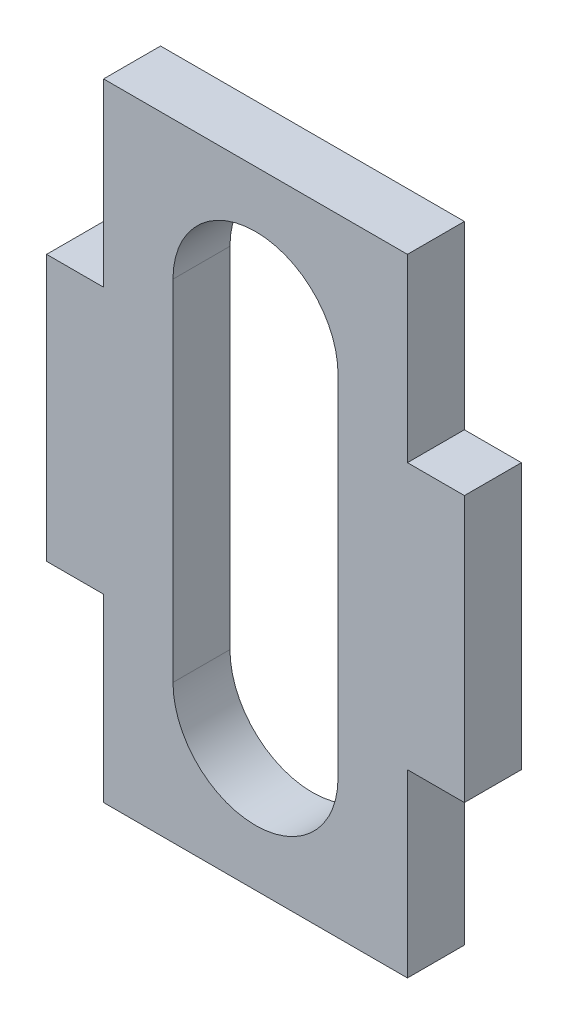
ISO-10303-21;
HEADER;
FILE_DESCRIPTION(('STEP AP214'),'2;1');
FILE_NAME('part.step','',(''),(''),'','','');
FILE_SCHEMA(('AUTOMOTIVE_DESIGN { 1 0 10303 214 1 1 1 1 }'));
ENDSEC;
DATA;
#1=APPLICATION_CONTEXT('core data for automotive mechanical design processes');
#2=APPLICATION_PROTOCOL_DEFINITION('international standard','automotive_design',2000,#1);
#3=PRODUCT_CONTEXT('',#1,'mechanical');
#4=PRODUCT('Part','Part','',(#3));
#5=PRODUCT_RELATED_PRODUCT_CATEGORY('part','',(#4));
#6=PRODUCT_DEFINITION_FORMATION('','',#4);
#7=PRODUCT_DEFINITION_CONTEXT('part definition',#1,'design');
#8=PRODUCT_DEFINITION('design','',#6,#7);
#9=PRODUCT_DEFINITION_SHAPE('','',#8);
#10=(LENGTH_UNIT() NAMED_UNIT(*) SI_UNIT(.MILLI.,.METRE.));
#11=(NAMED_UNIT(*) PLANE_ANGLE_UNIT() SI_UNIT($,.RADIAN.));
#12=(NAMED_UNIT(*) SI_UNIT($,.STERADIAN.) SOLID_ANGLE_UNIT());
#13=UNCERTAINTY_MEASURE_WITH_UNIT(LENGTH_MEASURE(1.E-05),#10,'distance_accuracy_value','');
#14=(GEOMETRIC_REPRESENTATION_CONTEXT(3) GLOBAL_UNCERTAINTY_ASSIGNED_CONTEXT((#13)) GLOBAL_UNIT_ASSIGNED_CONTEXT((#10,
#11,#12)) REPRESENTATION_CONTEXT('',''));
#15=CARTESIAN_POINT('',(0.,0.,0.));
#16=DIRECTION('',(0.,0.,1.));
#17=DIRECTION('',(1.,0.,0.));
#18=AXIS2_PLACEMENT_3D('',#15,#16,#17);
#19=CARTESIAN_POINT('',(7.99999999999999,-16.5,3.));
#20=DIRECTION('',(-1.,0.,0.));
#21=DIRECTION('',(0.,0.,1.));
#22=AXIS2_PLACEMENT_3D('',#19,#20,#21);
#23=PLANE('',#22);
#24=DIRECTION('',(0.,1.,0.));
#25=VECTOR('',#24,1.);
#26=CARTESIAN_POINT('',(7.99999999999999,-16.5,0.));
#27=LINE('',#26,#25);
#28=CARTESIAN_POINT('',(7.99999999999999,-16.5,0.));
#29=VERTEX_POINT('',#28);
#30=CARTESIAN_POINT('',(8.,-7.,0.));
#31=VERTEX_POINT('',#30);
#32=EDGE_CURVE('E237',#29,#31,#27,.T.);
#33=ORIENTED_EDGE('',*,*,#32,.T.);
#34=DIRECTION('',(0.,0.,1.));
#35=VECTOR('',#34,1.);
#36=CARTESIAN_POINT('',(7.99999999999999,-7.,3.));
#37=LINE('',#36,#35);
#38=CARTESIAN_POINT('',(8.,-7.,3.));
#39=VERTEX_POINT('',#38);
#40=EDGE_CURVE('E220',#31,#39,#37,.T.);
#41=ORIENTED_EDGE('',*,*,#40,.T.);
#42=DIRECTION('',(0.,1.,0.));
#43=VECTOR('',#42,1.);
#44=CARTESIAN_POINT('',(7.99999999999999,-16.5,3.));
#45=LINE('',#44,#43);
#46=CARTESIAN_POINT('',(7.99999999999999,-16.5,3.));
#47=VERTEX_POINT('',#46);
#48=EDGE_CURVE('E224',#47,#39,#45,.T.);
#49=ORIENTED_EDGE('',*,*,#48,.F.);
#50=DIRECTION('',(0.,0.,-1.));
#51=VECTOR('',#50,1.);
#52=CARTESIAN_POINT('',(7.99999999999999,-16.5,3.));
#53=LINE('',#52,#51);
#54=EDGE_CURVE('E236',#47,#29,#53,.T.);
#55=ORIENTED_EDGE('',*,*,#54,.T.);
#56=EDGE_LOOP('',(#33,#41,#49,#55));
#57=FACE_BOUND('',#56,.T.);
#58=ADVANCED_FACE('F37',(#57),#23,.F.);
#59=CARTESIAN_POINT('',(-8.00000000000001,-16.5,3.));
#60=DIRECTION('',(1.,0.,0.));
#61=DIRECTION('',(0.,0.,-1.));
#62=AXIS2_PLACEMENT_3D('',#59,#60,#61);
#63=PLANE('',#62);
#64=DIRECTION('',(0.,-1.,0.));
#65=VECTOR('',#64,1.);
#66=CARTESIAN_POINT('',(-8.00000000000001,-16.5,3.));
#67=LINE('',#66,#65);
#68=CARTESIAN_POINT('',(-8.00000000000001,-7.,3.));
#69=VERTEX_POINT('',#68);
#70=CARTESIAN_POINT('',(-8.00000000000001,-16.5,3.));
#71=VERTEX_POINT('',#70);
#72=EDGE_CURVE('E230',#69,#71,#67,.T.);
#73=ORIENTED_EDGE('',*,*,#72,.F.);
#74=DIRECTION('',(0.,0.,-1.));
#75=VECTOR('',#74,1.);
#76=CARTESIAN_POINT('',(-8.00000000000001,-7.,3.));
#77=LINE('',#76,#75);
#78=CARTESIAN_POINT('',(-8.00000000000001,-7.,0.));
#79=VERTEX_POINT('',#78);
#80=EDGE_CURVE('E217',#69,#79,#77,.T.);
#81=ORIENTED_EDGE('',*,*,#80,.T.);
#82=DIRECTION('',(0.,-1.,0.));
#83=VECTOR('',#82,1.);
#84=CARTESIAN_POINT('',(-8.00000000000001,-16.5,0.));
#85=LINE('',#84,#83);
#86=CARTESIAN_POINT('',(-8.00000000000001,-16.5,0.));
#87=VERTEX_POINT('',#86);
#88=EDGE_CURVE('E242',#79,#87,#85,.T.);
#89=ORIENTED_EDGE('',*,*,#88,.T.);
#90=DIRECTION('',(0.,0.,-1.));
#91=VECTOR('',#90,1.);
#92=CARTESIAN_POINT('',(-8.00000000000001,-16.5,3.));
#93=LINE('',#92,#91);
#94=EDGE_CURVE('E250',#71,#87,#93,.T.);
#95=ORIENTED_EDGE('',*,*,#94,.F.);
#96=EDGE_LOOP('',(#73,#81,#89,#95));
#97=FACE_BOUND('',#96,.T.);
#98=ADVANCED_FACE('F284',(#97),#63,.F.);
#99=CARTESIAN_POINT('',(7.99999999999999,7.,3.));
#100=VERTEX_POINT('',#99);
#101=CARTESIAN_POINT('',(7.99999999999999,16.5,3.));
#102=VERTEX_POINT('',#101);
#103=EDGE_CURVE('E228',#100,#102,#45,.T.);
#104=ORIENTED_EDGE('',*,*,#103,.F.);
#105=DIRECTION('',(0.,0.,-1.));
#106=VECTOR('',#105,1.);
#107=CARTESIAN_POINT('',(7.99999999999999,7.,3.));
#108=LINE('',#107,#106);
#109=CARTESIAN_POINT('',(8.,7.,0.));
#110=VERTEX_POINT('',#109);
#111=EDGE_CURVE('E214',#100,#110,#108,.T.);
#112=ORIENTED_EDGE('',*,*,#111,.T.);
#113=CARTESIAN_POINT('',(7.99999999999999,16.5,0.));
#114=VERTEX_POINT('',#113);
#115=EDGE_CURVE('E223',#110,#114,#27,.T.);
#116=ORIENTED_EDGE('',*,*,#115,.T.);
#117=DIRECTION('',(0.,0.,-1.));
#118=VECTOR('',#117,1.);
#119=CARTESIAN_POINT('',(7.99999999999999,16.5,3.));
#120=LINE('',#119,#118);
#121=EDGE_CURVE('E256',#102,#114,#120,.T.);
#122=ORIENTED_EDGE('',*,*,#121,.F.);
#123=EDGE_LOOP('',(#104,#112,#116,#122));
#124=FACE_BOUND('',#123,.T.);
#125=ADVANCED_FACE('F39',(#124),#23,.F.);
#126=CARTESIAN_POINT('',(-8.00000000000001,16.5,3.));
#127=DIRECTION('',(0.,-1.,0.));
#128=DIRECTION('',(0.,0.,-1.));
#129=AXIS2_PLACEMENT_3D('',#126,#127,#128);
#130=PLANE('',#129);
#131=DIRECTION('',(-1.,0.,0.));
#132=VECTOR('',#131,1.);
#133=CARTESIAN_POINT('',(-8.00000000000001,16.5,0.));
#134=LINE('',#133,#132);
#135=CARTESIAN_POINT('',(-8.00000000000001,16.5,0.));
#136=VERTEX_POINT('',#135);
#137=EDGE_CURVE('E240',#114,#136,#134,.T.);
#138=ORIENTED_EDGE('',*,*,#137,.T.);
#139=DIRECTION('',(0.,0.,-1.));
#140=VECTOR('',#139,1.);
#141=CARTESIAN_POINT('',(-8.00000000000001,16.5,3.));
#142=LINE('',#141,#140);
#143=CARTESIAN_POINT('',(-8.00000000000001,16.5,3.));
#144=VERTEX_POINT('',#143);
#145=EDGE_CURVE('E253',#144,#136,#142,.T.);
#146=ORIENTED_EDGE('',*,*,#145,.F.);
#147=DIRECTION('',(-1.,0.,0.));
#148=VECTOR('',#147,1.);
#149=CARTESIAN_POINT('',(-8.00000000000001,16.5,3.));
#150=LINE('',#149,#148);
#151=EDGE_CURVE('E227',#102,#144,#150,.T.);
#152=ORIENTED_EDGE('',*,*,#151,.F.);
#153=ORIENTED_EDGE('',*,*,#121,.T.);
#154=EDGE_LOOP('',(#138,#146,#152,#153));
#155=FACE_BOUND('',#154,.T.);
#156=ADVANCED_FACE('F293',(#155),#130,.F.);
#157=CARTESIAN_POINT('',(-8.00000000000001,7.,0.));
#158=VERTEX_POINT('',#157);
#159=EDGE_CURVE('E243',#136,#158,#85,.T.);
#160=ORIENTED_EDGE('',*,*,#159,.T.);
#161=DIRECTION('',(0.,0.,1.));
#162=VECTOR('',#161,1.);
#163=CARTESIAN_POINT('',(-8.00000000000001,7.,3.));
#164=LINE('',#163,#162);
#165=CARTESIAN_POINT('',(-8.00000000000001,7.,3.));
#166=VERTEX_POINT('',#165);
#167=EDGE_CURVE('E205',#158,#166,#164,.T.);
#168=ORIENTED_EDGE('',*,*,#167,.T.);
#169=EDGE_CURVE('E231',#144,#166,#67,.T.);
#170=ORIENTED_EDGE('',*,*,#169,.F.);
#171=ORIENTED_EDGE('',*,*,#145,.T.);
#172=EDGE_LOOP('',(#160,#168,#170,#171));
#173=FACE_BOUND('',#172,.T.);
#174=ADVANCED_FACE('F291',(#173),#63,.F.);
#175=CARTESIAN_POINT('',(-8.00000000000001,-16.5,3.));
#176=DIRECTION('',(0.,1.,0.));
#177=DIRECTION('',(0.,0.,1.));
#178=AXIS2_PLACEMENT_3D('',#175,#176,#177);
#179=PLANE('',#178);
#180=DIRECTION('',(1.,0.,0.));
#181=VECTOR('',#180,1.);
#182=CARTESIAN_POINT('',(-8.00000000000001,-16.5,0.));
#183=LINE('',#182,#181);
#184=EDGE_CURVE('E246',#87,#29,#183,.T.);
#185=ORIENTED_EDGE('',*,*,#184,.T.);
#186=ORIENTED_EDGE('',*,*,#54,.F.);
#187=DIRECTION('',(1.,0.,0.));
#188=VECTOR('',#187,1.);
#189=CARTESIAN_POINT('',(-8.00000000000001,-16.5,3.));
#190=LINE('',#189,#188);
#191=EDGE_CURVE('E234',#71,#47,#190,.T.);
#192=ORIENTED_EDGE('',*,*,#191,.F.);
#193=ORIENTED_EDGE('',*,*,#94,.T.);
#194=EDGE_LOOP('',(#185,#186,#192,#193));
#195=FACE_BOUND('',#194,.T.);
#196=ADVANCED_FACE('F330',(#195),#179,.F.);
#197=CARTESIAN_POINT('',(0.,0.,3.));
#198=DIRECTION('',(0.,0.,-1.));
#199=DIRECTION('',(-1.,0.,0.));
#200=AXIS2_PLACEMENT_3D('',#197,#198,#199);
#201=PLANE('',#200);
#202=DIRECTION('',(0.,-1.,0.));
#203=VECTOR('',#202,1.);
#204=CARTESIAN_POINT('',(-4.34549492077303,9.19606588526633,3.));
#205=LINE('',#204,#203);
#206=CARTESIAN_POINT('',(-4.34549492077303,9.19606588526633,3.));
#207=VERTEX_POINT('',#206);
#208=CARTESIAN_POINT('',(-4.34549492077302,-9.19606588526633,3.));
#209=VERTEX_POINT('',#208);
#210=EDGE_CURVE('E161',#207,#209,#205,.T.);
#211=ORIENTED_EDGE('',*,*,#210,.F.);
#212=CARTESIAN_POINT('',(0.,9.19606588526633,3.));
#213=DIRECTION('',(0.,0.,1.));
#214=DIRECTION('',(1.,0.,0.));
#215=AXIS2_PLACEMENT_3D('',#212,#213,#214);
#216=CIRCLE('',#215,4.34549492077301);
#217=CARTESIAN_POINT('',(4.345494920773,9.19606588526633,3.));
#218=VERTEX_POINT('',#217);
#219=EDGE_CURVE('E52',#218,#207,#216,.T.);
#220=ORIENTED_EDGE('',*,*,#219,.F.);
#221=DIRECTION('',(0.,1.,0.));
#222=VECTOR('',#221,1.);
#223=CARTESIAN_POINT('',(4.345494920773,9.19606588526633,3.));
#224=LINE('',#223,#222);
#225=CARTESIAN_POINT('',(4.345494920773,-9.19606588526633,3.));
#226=VERTEX_POINT('',#225);
#227=EDGE_CURVE('E168',#226,#218,#224,.T.);
#228=ORIENTED_EDGE('',*,*,#227,.F.);
#229=CARTESIAN_POINT('',(0.,-9.19606588526633,3.));
#230=DIRECTION('',(0.,0.,1.));
#231=DIRECTION('',(1.,0.,0.));
#232=AXIS2_PLACEMENT_3D('',#229,#230,#231);
#233=CIRCLE('',#232,4.34549492077301);
#234=EDGE_CURVE('E152',#209,#226,#233,.T.);
#235=ORIENTED_EDGE('',*,*,#234,.F.);
#236=EDGE_LOOP('',(#211,#220,#228,#235));
#237=FACE_BOUND('',#236,.T.);
#238=ORIENTED_EDGE('',*,*,#169,.T.);
#239=DIRECTION('',(-1.,0.,0.));
#240=VECTOR('',#239,1.);
#241=CARTESIAN_POINT('',(-11.,7.,3.));
#242=LINE('',#241,#240);
#243=CARTESIAN_POINT('',(-11.,7.,3.));
#244=VERTEX_POINT('',#243);
#245=EDGE_CURVE('E194',#166,#244,#242,.T.);
#246=ORIENTED_EDGE('',*,*,#245,.T.);
#247=DIRECTION('',(0.,-1.,0.));
#248=VECTOR('',#247,1.);
#249=CARTESIAN_POINT('',(-11.,-7.,3.));
#250=LINE('',#249,#248);
#251=CARTESIAN_POINT('',(-11.,-7.,3.));
#252=VERTEX_POINT('',#251);
#253=EDGE_CURVE('E197',#244,#252,#250,.T.);
#254=ORIENTED_EDGE('',*,*,#253,.T.);
#255=DIRECTION('',(1.,0.,0.));
#256=VECTOR('',#255,1.);
#257=CARTESIAN_POINT('',(-11.,-7.,3.));
#258=LINE('',#257,#256);
#259=EDGE_CURVE('E182',#252,#69,#258,.T.);
#260=ORIENTED_EDGE('',*,*,#259,.T.);
#261=ORIENTED_EDGE('',*,*,#72,.T.);
#262=ORIENTED_EDGE('',*,*,#191,.T.);
#263=ORIENTED_EDGE('',*,*,#48,.T.);
#264=CARTESIAN_POINT('',(11.,-7.,3.));
#265=VERTEX_POINT('',#264);
#266=EDGE_CURVE('E200',#39,#265,#258,.T.);
#267=ORIENTED_EDGE('',*,*,#266,.T.);
#268=DIRECTION('',(0.,1.,0.));
#269=VECTOR('',#268,1.);
#270=CARTESIAN_POINT('',(11.,-7.,3.));
#271=LINE('',#270,#269);
#272=CARTESIAN_POINT('',(11.,7.,3.));
#273=VERTEX_POINT('',#272);
#274=EDGE_CURVE('E175',#265,#273,#271,.T.);
#275=ORIENTED_EDGE('',*,*,#274,.T.);
#276=EDGE_CURVE('E195',#273,#100,#242,.T.);
#277=ORIENTED_EDGE('',*,*,#276,.T.);
#278=ORIENTED_EDGE('',*,*,#103,.T.);
#279=ORIENTED_EDGE('',*,*,#151,.T.);
#280=EDGE_LOOP('',(#238,#246,#254,#260,#261,#262,#263,#267,#275,#277,#278,#279));
#281=FACE_BOUND('',#280,.T.);
#282=ADVANCED_FACE('F165',(#237,#281),#201,.F.);
#283=CARTESIAN_POINT('',(0.,0.,0.));
#284=DIRECTION('',(0.,0.,-1.));
#285=DIRECTION('',(-1.,0.,0.));
#286=AXIS2_PLACEMENT_3D('',#283,#284,#285);
#287=PLANE('',#286);
#288=CARTESIAN_POINT('',(0.,9.19606588526633,0.));
#289=DIRECTION('',(0.,0.,-1.));
#290=DIRECTION('',(-1.,0.,0.));
#291=AXIS2_PLACEMENT_3D('',#288,#289,#290);
#292=CIRCLE('',#291,4.34549492077301);
#293=CARTESIAN_POINT('',(-4.34549492077303,9.19606588526633,0.));
#294=VERTEX_POINT('',#293);
#295=CARTESIAN_POINT('',(4.345494920773,9.19606588526633,0.));
#296=VERTEX_POINT('',#295);
#297=EDGE_CURVE('E11',#294,#296,#292,.T.);
#298=ORIENTED_EDGE('',*,*,#297,.F.);
#299=DIRECTION('',(0.,1.,0.));
#300=VECTOR('',#299,1.);
#301=CARTESIAN_POINT('',(-4.34549492077303,0.,0.));
#302=LINE('',#301,#300);
#303=CARTESIAN_POINT('',(-4.34549492077302,-9.19606588526633,0.));
#304=VERTEX_POINT('',#303);
#305=EDGE_CURVE('E259',#304,#294,#302,.T.);
#306=ORIENTED_EDGE('',*,*,#305,.F.);
#307=CARTESIAN_POINT('',(0.,-9.19606588526633,0.));
#308=DIRECTION('',(0.,0.,-1.));
#309=DIRECTION('',(-1.,0.,0.));
#310=AXIS2_PLACEMENT_3D('',#307,#308,#309);
#311=CIRCLE('',#310,4.34549492077301);
#312=CARTESIAN_POINT('',(4.345494920773,-9.19606588526633,0.));
#313=VERTEX_POINT('',#312);
#314=EDGE_CURVE('E155',#313,#304,#311,.T.);
#315=ORIENTED_EDGE('',*,*,#314,.F.);
#316=DIRECTION('',(0.,-1.,0.));
#317=VECTOR('',#316,1.);
#318=CARTESIAN_POINT('',(4.345494920773,0.,0.));
#319=LINE('',#318,#317);
#320=EDGE_CURVE('E45',#296,#313,#319,.T.);
#321=ORIENTED_EDGE('',*,*,#320,.F.);
#322=EDGE_LOOP('',(#298,#306,#315,#321));
#323=FACE_BOUND('',#322,.T.);
#324=ORIENTED_EDGE('',*,*,#115,.F.);
#325=DIRECTION('',(-1.,0.,0.));
#326=VECTOR('',#325,1.);
#327=CARTESIAN_POINT('',(-11.,7.,0.));
#328=LINE('',#327,#326);
#329=CARTESIAN_POINT('',(11.,7.,0.));
#330=VERTEX_POINT('',#329);
#331=EDGE_CURVE('E183',#330,#110,#328,.T.);
#332=ORIENTED_EDGE('',*,*,#331,.F.);
#333=DIRECTION('',(0.,1.,0.));
#334=VECTOR('',#333,1.);
#335=CARTESIAN_POINT('',(11.,-7.,0.));
#336=LINE('',#335,#334);
#337=CARTESIAN_POINT('',(11.,-7.,0.));
#338=VERTEX_POINT('',#337);
#339=EDGE_CURVE('E178',#338,#330,#336,.T.);
#340=ORIENTED_EDGE('',*,*,#339,.F.);
#341=DIRECTION('',(1.,0.,0.));
#342=VECTOR('',#341,1.);
#343=CARTESIAN_POINT('',(-11.,-7.,0.));
#344=LINE('',#343,#342);
#345=EDGE_CURVE('E188',#31,#338,#344,.T.);
#346=ORIENTED_EDGE('',*,*,#345,.F.);
#347=ORIENTED_EDGE('',*,*,#32,.F.);
#348=ORIENTED_EDGE('',*,*,#184,.F.);
#349=ORIENTED_EDGE('',*,*,#88,.F.);
#350=CARTESIAN_POINT('',(-11.,-7.,0.));
#351=VERTEX_POINT('',#350);
#352=EDGE_CURVE('E189',#351,#79,#344,.T.);
#353=ORIENTED_EDGE('',*,*,#352,.F.);
#354=DIRECTION('',(0.,-1.,0.));
#355=VECTOR('',#354,1.);
#356=CARTESIAN_POINT('',(-11.,-7.,0.));
#357=LINE('',#356,#355);
#358=CARTESIAN_POINT('',(-11.,7.,0.));
#359=VERTEX_POINT('',#358);
#360=EDGE_CURVE('E185',#359,#351,#357,.T.);
#361=ORIENTED_EDGE('',*,*,#360,.F.);
#362=EDGE_CURVE('E181',#158,#359,#328,.T.);
#363=ORIENTED_EDGE('',*,*,#362,.F.);
#364=ORIENTED_EDGE('',*,*,#159,.F.);
#365=ORIENTED_EDGE('',*,*,#137,.F.);
#366=EDGE_LOOP('',(#324,#332,#340,#346,#347,#348,#349,#353,#361,#363,#364,#365));
#367=FACE_BOUND('',#366,.T.);
#368=ADVANCED_FACE('F267',(#323,#367),#287,.T.);
#369=CARTESIAN_POINT('',(-11.,-7.,0.));
#370=DIRECTION('',(-1.,0.,0.));
#371=DIRECTION('',(0.,0.,1.));
#372=AXIS2_PLACEMENT_3D('',#369,#370,#371);
#373=PLANE('',#372);
#374=ORIENTED_EDGE('',*,*,#253,.F.);
#375=DIRECTION('',(0.,0.,1.));
#376=VECTOR('',#375,1.);
#377=CARTESIAN_POINT('',(-11.,7.,0.));
#378=LINE('',#377,#376);
#379=EDGE_CURVE('E208',#359,#244,#378,.T.);
#380=ORIENTED_EDGE('',*,*,#379,.F.);
#381=ORIENTED_EDGE('',*,*,#360,.T.);
#382=DIRECTION('',(0.,0.,1.));
#383=VECTOR('',#382,1.);
#384=CARTESIAN_POINT('',(-11.,-7.,0.));
#385=LINE('',#384,#383);
#386=EDGE_CURVE('E206',#351,#252,#385,.T.);
#387=ORIENTED_EDGE('',*,*,#386,.T.);
#388=EDGE_LOOP('',(#374,#380,#381,#387));
#389=FACE_BOUND('',#388,.T.);
#390=ADVANCED_FACE('F318',(#389),#373,.T.);
#391=CARTESIAN_POINT('',(-11.,7.,0.));
#392=DIRECTION('',(0.,1.,0.));
#393=DIRECTION('',(0.,0.,1.));
#394=AXIS2_PLACEMENT_3D('',#391,#392,#393);
#395=PLANE('',#394);
#396=ORIENTED_EDGE('',*,*,#167,.F.);
#397=ORIENTED_EDGE('',*,*,#362,.T.);
#398=ORIENTED_EDGE('',*,*,#379,.T.);
#399=ORIENTED_EDGE('',*,*,#245,.F.);
#400=EDGE_LOOP('',(#396,#397,#398,#399));
#401=FACE_BOUND('',#400,.T.);
#402=ADVANCED_FACE('F314',(#401),#395,.T.);
#403=CARTESIAN_POINT('',(-11.,-7.,0.));
#404=DIRECTION('',(0.,-1.,0.));
#405=DIRECTION('',(0.,0.,-1.));
#406=AXIS2_PLACEMENT_3D('',#403,#404,#405);
#407=PLANE('',#406);
#408=ORIENTED_EDGE('',*,*,#80,.F.);
#409=ORIENTED_EDGE('',*,*,#259,.F.);
#410=ORIENTED_EDGE('',*,*,#386,.F.);
#411=ORIENTED_EDGE('',*,*,#352,.T.);
#412=EDGE_LOOP('',(#408,#409,#410,#411));
#413=FACE_BOUND('',#412,.T.);
#414=ADVANCED_FACE('F322',(#413),#407,.T.);
#415=ORIENTED_EDGE('',*,*,#40,.F.);
#416=ORIENTED_EDGE('',*,*,#345,.T.);
#417=DIRECTION('',(0.,0.,1.));
#418=VECTOR('',#417,1.);
#419=CARTESIAN_POINT('',(11.,-7.,0.));
#420=LINE('',#419,#418);
#421=EDGE_CURVE('E202',#338,#265,#420,.T.);
#422=ORIENTED_EDGE('',*,*,#421,.T.);
#423=ORIENTED_EDGE('',*,*,#266,.F.);
#424=EDGE_LOOP('',(#415,#416,#422,#423));
#425=FACE_BOUND('',#424,.T.);
#426=ADVANCED_FACE('F336',(#425),#407,.T.);
#427=ORIENTED_EDGE('',*,*,#111,.F.);
#428=ORIENTED_EDGE('',*,*,#276,.F.);
#429=DIRECTION('',(0.,0.,1.));
#430=VECTOR('',#429,1.);
#431=CARTESIAN_POINT('',(11.,7.,0.));
#432=LINE('',#431,#430);
#433=EDGE_CURVE('E191',#330,#273,#432,.T.);
#434=ORIENTED_EDGE('',*,*,#433,.F.);
#435=ORIENTED_EDGE('',*,*,#331,.T.);
#436=EDGE_LOOP('',(#427,#428,#434,#435));
#437=FACE_BOUND('',#436,.T.);
#438=ADVANCED_FACE('F278',(#437),#395,.T.);
#439=CARTESIAN_POINT('',(11.,-7.,0.));
#440=DIRECTION('',(1.,0.,0.));
#441=DIRECTION('',(0.,0.,-1.));
#442=AXIS2_PLACEMENT_3D('',#439,#440,#441);
#443=PLANE('',#442);
#444=ORIENTED_EDGE('',*,*,#274,.F.);
#445=ORIENTED_EDGE('',*,*,#421,.F.);
#446=ORIENTED_EDGE('',*,*,#339,.T.);
#447=ORIENTED_EDGE('',*,*,#433,.T.);
#448=EDGE_LOOP('',(#444,#445,#446,#447));
#449=FACE_BOUND('',#448,.T.);
#450=ADVANCED_FACE('F271',(#449),#443,.T.);
#451=CARTESIAN_POINT('',(0.,9.19606588526633,-7.));
#452=DIRECTION('',(0.,0.,1.));
#453=DIRECTION('',(1.,0.,0.));
#454=AXIS2_PLACEMENT_3D('',#451,#452,#453);
#455=CYLINDRICAL_SURFACE('',#454,4.34549492077301);
#456=ORIENTED_EDGE('',*,*,#297,.T.);
#457=DIRECTION('',(0.,0.,1.));
#458=VECTOR('',#457,1.);
#459=CARTESIAN_POINT('',(4.345494920773,9.19606588526633,-7.));
#460=LINE('',#459,#458);
#461=EDGE_CURVE('E173',#296,#218,#460,.T.);
#462=ORIENTED_EDGE('',*,*,#461,.T.);
#463=ORIENTED_EDGE('',*,*,#219,.T.);
#464=DIRECTION('',(0.,0.,1.));
#465=VECTOR('',#464,1.);
#466=CARTESIAN_POINT('',(-4.34549492077303,9.19606588526633,-7.));
#467=LINE('',#466,#465);
#468=EDGE_CURVE('E158',#294,#207,#467,.T.);
#469=ORIENTED_EDGE('',*,*,#468,.F.);
#470=EDGE_LOOP('',(#456,#462,#463,#469));
#471=FACE_BOUND('',#470,.T.);
#472=ADVANCED_FACE('F269',(#471),#455,.F.);
#473=CARTESIAN_POINT('',(4.345494920773,9.19606588526633,-7.));
#474=DIRECTION('',(1.,0.,0.));
#475=DIRECTION('',(0.,1.,0.));
#476=AXIS2_PLACEMENT_3D('',#473,#474,#475);
#477=PLANE('',#476);
#478=ORIENTED_EDGE('',*,*,#320,.T.);
#479=DIRECTION('',(0.,0.,1.));
#480=VECTOR('',#479,1.);
#481=CARTESIAN_POINT('',(4.345494920773,-9.19606588526633,-7.));
#482=LINE('',#481,#480);
#483=EDGE_CURVE('E157',#313,#226,#482,.T.);
#484=ORIENTED_EDGE('',*,*,#483,.T.);
#485=ORIENTED_EDGE('',*,*,#227,.T.);
#486=ORIENTED_EDGE('',*,*,#461,.F.);
#487=EDGE_LOOP('',(#478,#484,#485,#486));
#488=FACE_BOUND('',#487,.T.);
#489=ADVANCED_FACE('F264',(#488),#477,.F.);
#490=CARTESIAN_POINT('',(0.,-9.19606588526633,-7.));
#491=DIRECTION('',(0.,0.,1.));
#492=DIRECTION('',(1.,0.,0.));
#493=AXIS2_PLACEMENT_3D('',#490,#491,#492);
#494=CYLINDRICAL_SURFACE('',#493,4.34549492077301);
#495=ORIENTED_EDGE('',*,*,#314,.T.);
#496=DIRECTION('',(0.,0.,1.));
#497=VECTOR('',#496,1.);
#498=CARTESIAN_POINT('',(-4.34549492077302,-9.19606588526633,-7.));
#499=LINE('',#498,#497);
#500=EDGE_CURVE('E60',#304,#209,#499,.T.);
#501=ORIENTED_EDGE('',*,*,#500,.T.);
#502=ORIENTED_EDGE('',*,*,#234,.T.);
#503=ORIENTED_EDGE('',*,*,#483,.F.);
#504=EDGE_LOOP('',(#495,#501,#502,#503));
#505=FACE_BOUND('',#504,.T.);
#506=ADVANCED_FACE('F149',(#505),#494,.F.);
#507=CARTESIAN_POINT('',(-4.34549492077303,9.19606588526633,-7.));
#508=DIRECTION('',(-1.,0.,0.));
#509=DIRECTION('',(0.,-1.,0.));
#510=AXIS2_PLACEMENT_3D('',#507,#508,#509);
#511=PLANE('',#510);
#512=ORIENTED_EDGE('',*,*,#305,.T.);
#513=ORIENTED_EDGE('',*,*,#468,.T.);
#514=ORIENTED_EDGE('',*,*,#210,.T.);
#515=ORIENTED_EDGE('',*,*,#500,.F.);
#516=EDGE_LOOP('',(#512,#513,#514,#515));
#517=FACE_BOUND('',#516,.T.);
#518=ADVANCED_FACE('F162',(#517),#511,.F.);
#519=CLOSED_SHELL('',(#58,#98,#125,#156,#174,#196,#282,#368,#390,#402,#414,#426,#438,#450,#472,
#489,#506,#518));
#520=MANIFOLD_SOLID_BREP('B2',#519);
#521=ADVANCED_BREP_SHAPE_REPRESENTATION('',(#18,#520),#14);
#522=SHAPE_DEFINITION_REPRESENTATION(#9,#521);
ENDSEC;
END-ISO-10303-21;
